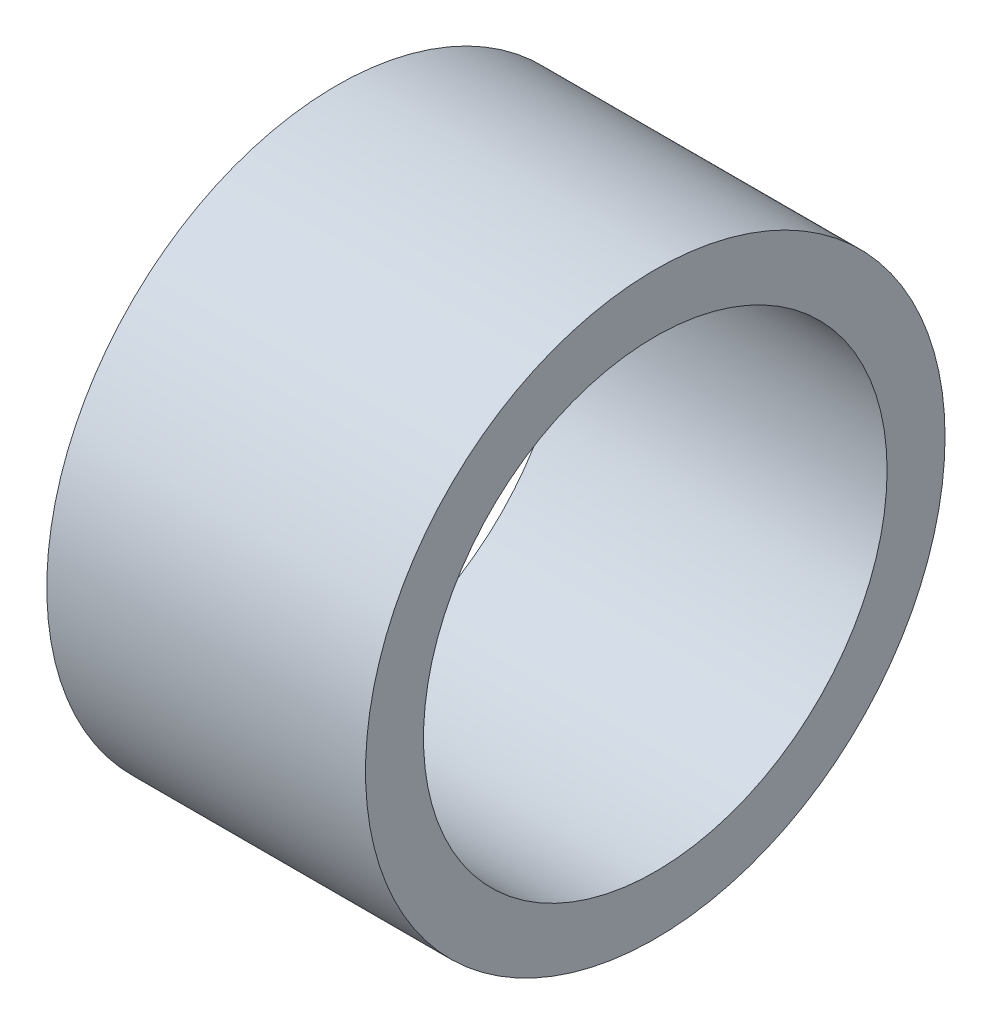
ISO-10303-21;
HEADER;
FILE_DESCRIPTION(('STEP AP214'),'2;1');
FILE_NAME('part.step','',(''),(''),'','','');
FILE_SCHEMA(('AUTOMOTIVE_DESIGN { 1 0 10303 214 1 1 1 1 }'));
ENDSEC;
DATA;
#1=APPLICATION_CONTEXT('core data for automotive mechanical design processes');
#2=APPLICATION_PROTOCOL_DEFINITION('international standard','automotive_design',2000,#1);
#3=PRODUCT_CONTEXT('',#1,'mechanical');
#4=PRODUCT('Part','Part','',(#3));
#5=PRODUCT_RELATED_PRODUCT_CATEGORY('part','',(#4));
#6=PRODUCT_DEFINITION_FORMATION('','',#4);
#7=PRODUCT_DEFINITION_CONTEXT('part definition',#1,'design');
#8=PRODUCT_DEFINITION('design','',#6,#7);
#9=PRODUCT_DEFINITION_SHAPE('','',#8);
#10=(LENGTH_UNIT() NAMED_UNIT(*) SI_UNIT(.MILLI.,.METRE.));
#11=(NAMED_UNIT(*) PLANE_ANGLE_UNIT() SI_UNIT($,.RADIAN.));
#12=(NAMED_UNIT(*) SI_UNIT($,.STERADIAN.) SOLID_ANGLE_UNIT());
#13=UNCERTAINTY_MEASURE_WITH_UNIT(LENGTH_MEASURE(1.E-05),#10,'distance_accuracy_value','');
#14=(GEOMETRIC_REPRESENTATION_CONTEXT(3) GLOBAL_UNCERTAINTY_ASSIGNED_CONTEXT((#13)) GLOBAL_UNIT_ASSIGNED_CONTEXT((#10,
#11,#12)) REPRESENTATION_CONTEXT('',''));
#15=CARTESIAN_POINT('',(0.,0.,0.));
#16=DIRECTION('',(0.,0.,1.));
#17=DIRECTION('',(1.,0.,0.));
#18=AXIS2_PLACEMENT_3D('',#15,#16,#17);
#19=CARTESIAN_POINT('',(21.25,0.,0.));
#20=DIRECTION('',(1.,0.,0.));
#21=DIRECTION('',(0.,0.,-1.));
#22=AXIS2_PLACEMENT_3D('',#19,#20,#21);
#23=CYLINDRICAL_SURFACE('',#22,4.);
#24=CARTESIAN_POINT('',(24.,0.,0.));
#25=DIRECTION('',(1.,0.,0.));
#26=DIRECTION('',(0.,0.,-1.));
#27=AXIS2_PLACEMENT_3D('',#24,#25,#26);
#28=CIRCLE('',#27,4.);
#29=CARTESIAN_POINT('',(24.,0.,-4.));
#30=VERTEX_POINT('',#29);
#31=EDGE_CURVE('E18',#30,#30,#28,.F.);
#32=ORIENTED_EDGE('',*,*,#31,.F.);
#33=EDGE_LOOP('',(#32));
#34=FACE_BOUND('',#33,.T.);
#35=CARTESIAN_POINT('',(18.5,0.,0.));
#36=DIRECTION('',(1.,0.,0.));
#37=DIRECTION('',(0.,0.,-1.));
#38=AXIS2_PLACEMENT_3D('',#35,#36,#37);
#39=CIRCLE('',#38,4.);
#40=CARTESIAN_POINT('',(18.5,0.,-4.));
#41=VERTEX_POINT('',#40);
#42=EDGE_CURVE('E27',#41,#41,#39,.T.);
#43=ORIENTED_EDGE('',*,*,#42,.F.);
#44=EDGE_LOOP('',(#43));
#45=FACE_BOUND('',#44,.T.);
#46=ADVANCED_FACE('F15',(#34,#45),#23,.F.);
#47=CARTESIAN_POINT('',(24.,4.5,0.));
#48=DIRECTION('',(1.,0.,0.));
#49=DIRECTION('',(0.,0.,-1.));
#50=AXIS2_PLACEMENT_3D('',#47,#48,#49);
#51=PLANE('',#50);
#52=ORIENTED_EDGE('',*,*,#31,.T.);
#53=EDGE_LOOP('',(#52));
#54=FACE_BOUND('',#53,.T.);
#55=CARTESIAN_POINT('',(24.,0.,0.));
#56=DIRECTION('',(1.,0.,0.));
#57=DIRECTION('',(0.,0.,-1.));
#58=AXIS2_PLACEMENT_3D('',#55,#56,#57);
#59=CIRCLE('',#58,5.);
#60=CARTESIAN_POINT('',(24.,0.,-5.));
#61=VERTEX_POINT('',#60);
#62=EDGE_CURVE('E22',#61,#61,#59,.F.);
#63=ORIENTED_EDGE('',*,*,#62,.F.);
#64=EDGE_LOOP('',(#63));
#65=FACE_BOUND('',#64,.T.);
#66=ADVANCED_FACE('F35',(#54,#65),#51,.T.);
#67=CARTESIAN_POINT('',(18.5,4.5,0.));
#68=DIRECTION('',(-1.,0.,0.));
#69=DIRECTION('',(0.,0.,1.));
#70=AXIS2_PLACEMENT_3D('',#67,#68,#69);
#71=PLANE('',#70);
#72=CARTESIAN_POINT('',(18.5,0.,0.));
#73=DIRECTION('',(1.,0.,0.));
#74=DIRECTION('',(0.,0.,-1.));
#75=AXIS2_PLACEMENT_3D('',#72,#73,#74);
#76=CIRCLE('',#75,5.);
#77=CARTESIAN_POINT('',(18.5,0.,-5.));
#78=VERTEX_POINT('',#77);
#79=EDGE_CURVE('E10',#78,#78,#76,.T.);
#80=ORIENTED_EDGE('',*,*,#79,.F.);
#81=EDGE_LOOP('',(#80));
#82=FACE_BOUND('',#81,.T.);
#83=ORIENTED_EDGE('',*,*,#42,.T.);
#84=EDGE_LOOP('',(#83));
#85=FACE_BOUND('',#84,.T.);
#86=ADVANCED_FACE('F44',(#82,#85),#71,.T.);
#87=CARTESIAN_POINT('',(21.25,0.,0.));
#88=DIRECTION('',(1.,0.,0.));
#89=DIRECTION('',(0.,0.,-1.));
#90=AXIS2_PLACEMENT_3D('',#87,#88,#89);
#91=CYLINDRICAL_SURFACE('',#90,5.);
#92=ORIENTED_EDGE('',*,*,#62,.T.);
#93=EDGE_LOOP('',(#92));
#94=FACE_BOUND('',#93,.T.);
#95=ORIENTED_EDGE('',*,*,#79,.T.);
#96=EDGE_LOOP('',(#95));
#97=FACE_BOUND('',#96,.T.);
#98=ADVANCED_FACE('F45',(#94,#97),#91,.T.);
#99=CLOSED_SHELL('',(#46,#66,#86,#98));
#100=MANIFOLD_SOLID_BREP('B1',#99);
#101=ADVANCED_BREP_SHAPE_REPRESENTATION('',(#18,#100),#14);
#102=SHAPE_DEFINITION_REPRESENTATION(#9,#101);
ENDSEC;
END-ISO-10303-21;
